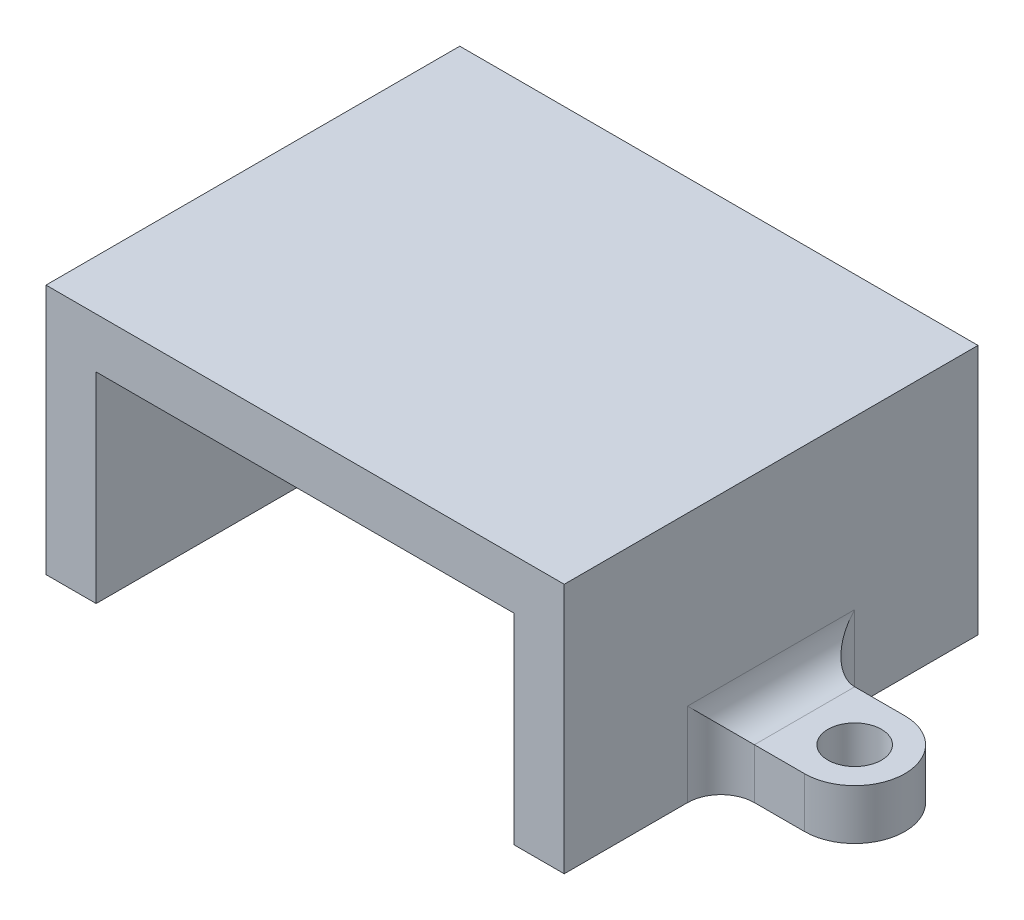
ISO-10303-21;
HEADER;
FILE_DESCRIPTION(('STEP AP214'),'2;1');
FILE_NAME('part.step','',(''),(''),'','','');
FILE_SCHEMA(('AUTOMOTIVE_DESIGN { 1 0 10303 214 1 1 1 1 }'));
ENDSEC;
DATA;
#1=APPLICATION_CONTEXT('core data for automotive mechanical design processes');
#2=APPLICATION_PROTOCOL_DEFINITION('international standard','automotive_design',2000,#1);
#3=PRODUCT_CONTEXT('',#1,'mechanical');
#4=PRODUCT('Part','Part','',(#3));
#5=PRODUCT_RELATED_PRODUCT_CATEGORY('part','',(#4));
#6=PRODUCT_DEFINITION_FORMATION('','',#4);
#7=PRODUCT_DEFINITION_CONTEXT('part definition',#1,'design');
#8=PRODUCT_DEFINITION('design','',#6,#7);
#9=PRODUCT_DEFINITION_SHAPE('','',#8);
#10=(LENGTH_UNIT() NAMED_UNIT(*) SI_UNIT(.MILLI.,.METRE.));
#11=(NAMED_UNIT(*) PLANE_ANGLE_UNIT() SI_UNIT($,.RADIAN.));
#12=(NAMED_UNIT(*) SI_UNIT($,.STERADIAN.) SOLID_ANGLE_UNIT());
#13=UNCERTAINTY_MEASURE_WITH_UNIT(LENGTH_MEASURE(1.E-05),#10,'distance_accuracy_value','');
#14=(GEOMETRIC_REPRESENTATION_CONTEXT(3) GLOBAL_UNCERTAINTY_ASSIGNED_CONTEXT((#13)) GLOBAL_UNIT_ASSIGNED_CONTEXT((#10,
#11,#12)) REPRESENTATION_CONTEXT('',''));
#15=CARTESIAN_POINT('',(0.,0.,0.));
#16=DIRECTION('',(0.,0.,1.));
#17=DIRECTION('',(1.,0.,0.));
#18=AXIS2_PLACEMENT_3D('',#15,#16,#17);
#19=CARTESIAN_POINT('',(31.,0.,24.75));
#20=DIRECTION('',(-1.,0.,0.));
#21=DIRECTION('',(0.,0.,1.));
#22=AXIS2_PLACEMENT_3D('',#19,#20,#21);
#23=PLANE('',#22);
#24=DIRECTION('',(0.,0.,-1.));
#25=VECTOR('',#24,1.);
#26=CARTESIAN_POINT('',(31.,5.,9.375));
#27=LINE('',#26,#25);
#28=CARTESIAN_POINT('',(31.,5.,17.375));
#29=VERTEX_POINT('',#28);
#30=CARTESIAN_POINT('',(31.,5.,7.375));
#31=VERTEX_POINT('',#30);
#32=EDGE_CURVE('E348',#29,#31,#27,.T.);
#33=ORIENTED_EDGE('',*,*,#32,.T.);
#34=DIRECTION('',(0.,-1.,0.));
#35=VECTOR('',#34,1.);
#36=CARTESIAN_POINT('',(31.,0.,7.375));
#37=LINE('',#36,#35);
#38=CARTESIAN_POINT('',(31.,0.,7.375));
#39=VERTEX_POINT('',#38);
#40=EDGE_CURVE('E351',#31,#39,#37,.T.);
#41=ORIENTED_EDGE('',*,*,#40,.T.);
#42=DIRECTION('',(0.,0.,-1.));
#43=VECTOR('',#42,1.);
#44=CARTESIAN_POINT('',(31.,0.,24.75));
#45=LINE('',#44,#43);
#46=CARTESIAN_POINT('',(31.,0.,0.));
#47=VERTEX_POINT('',#46);
#48=EDGE_CURVE('E320',#39,#47,#45,.T.);
#49=ORIENTED_EDGE('',*,*,#48,.T.);
#50=DIRECTION('',(0.,1.,0.));
#51=VECTOR('',#50,1.);
#52=CARTESIAN_POINT('',(31.,0.,0.));
#53=LINE('',#52,#51);
#54=CARTESIAN_POINT('',(31.,15.,0.));
#55=VERTEX_POINT('',#54);
#56=EDGE_CURVE('E308',#47,#55,#53,.T.);
#57=ORIENTED_EDGE('',*,*,#56,.T.);
#58=DIRECTION('',(0.,0.,-1.));
#59=VECTOR('',#58,1.);
#60=CARTESIAN_POINT('',(31.,15.,24.75));
#61=LINE('',#60,#59);
#62=CARTESIAN_POINT('',(31.,15.,24.75));
#63=VERTEX_POINT('',#62);
#64=EDGE_CURVE('E316',#63,#55,#61,.T.);
#65=ORIENTED_EDGE('',*,*,#64,.F.);
#66=DIRECTION('',(0.,1.,0.));
#67=VECTOR('',#66,1.);
#68=CARTESIAN_POINT('',(31.,0.,24.75));
#69=LINE('',#68,#67);
#70=CARTESIAN_POINT('',(31.,0.,24.75));
#71=VERTEX_POINT('',#70);
#72=EDGE_CURVE('E282',#71,#63,#69,.T.);
#73=ORIENTED_EDGE('',*,*,#72,.F.);
#74=CARTESIAN_POINT('',(31.,0.,17.375));
#75=VERTEX_POINT('',#74);
#76=EDGE_CURVE('E321',#71,#75,#45,.T.);
#77=ORIENTED_EDGE('',*,*,#76,.T.);
#78=DIRECTION('',(0.,-1.,0.));
#79=VECTOR('',#78,1.);
#80=CARTESIAN_POINT('',(31.,0.,17.375));
#81=LINE('',#80,#79);
#82=EDGE_CURVE('E345',#75,#29,#81,.F.);
#83=ORIENTED_EDGE('',*,*,#82,.T.);
#84=EDGE_LOOP('',(#33,#41,#49,#57,#65,#73,#77,#83));
#85=FACE_BOUND('',#84,.T.);
#86=ADVANCED_FACE('F39',(#85),#23,.F.);
#87=CARTESIAN_POINT('',(0.,15.,24.75));
#88=DIRECTION('',(1.,0.,0.));
#89=DIRECTION('',(0.,0.,-1.));
#90=AXIS2_PLACEMENT_3D('',#87,#88,#89);
#91=PLANE('',#90);
#92=DIRECTION('',(0.,0.,-1.));
#93=VECTOR('',#92,1.);
#94=CARTESIAN_POINT('',(0.,0.,24.75));
#95=LINE('',#94,#93);
#96=CARTESIAN_POINT('',(0.,0.,7.375));
#97=VERTEX_POINT('',#96);
#98=CARTESIAN_POINT('',(0.,0.,0.));
#99=VERTEX_POINT('',#98);
#100=EDGE_CURVE('E341',#97,#99,#95,.T.);
#101=ORIENTED_EDGE('',*,*,#100,.F.);
#102=DIRECTION('',(0.,-1.,0.));
#103=VECTOR('',#102,1.);
#104=CARTESIAN_POINT('',(0.,15.,7.375));
#105=LINE('',#104,#103);
#106=CARTESIAN_POINT('',(0.,5.,7.375));
#107=VERTEX_POINT('',#106);
#108=EDGE_CURVE('E373',#97,#107,#105,.F.);
#109=ORIENTED_EDGE('',*,*,#108,.T.);
#110=DIRECTION('',(0.,0.,1.));
#111=VECTOR('',#110,1.);
#112=CARTESIAN_POINT('',(0.,5.,24.75));
#113=LINE('',#112,#111);
#114=CARTESIAN_POINT('',(0.,5.,17.375));
#115=VERTEX_POINT('',#114);
#116=EDGE_CURVE('E367',#107,#115,#113,.T.);
#117=ORIENTED_EDGE('',*,*,#116,.T.);
#118=DIRECTION('',(0.,-1.,0.));
#119=VECTOR('',#118,1.);
#120=CARTESIAN_POINT('',(0.,15.,17.375));
#121=LINE('',#120,#119);
#122=CARTESIAN_POINT('',(0.,0.,17.375));
#123=VERTEX_POINT('',#122);
#124=EDGE_CURVE('E370',#115,#123,#121,.T.);
#125=ORIENTED_EDGE('',*,*,#124,.T.);
#126=CARTESIAN_POINT('',(0.,0.,24.75));
#127=VERTEX_POINT('',#126);
#128=EDGE_CURVE('E342',#127,#123,#95,.T.);
#129=ORIENTED_EDGE('',*,*,#128,.F.);
#130=DIRECTION('',(0.,-1.,0.));
#131=VECTOR('',#130,1.);
#132=CARTESIAN_POINT('',(0.,15.,24.75));
#133=LINE('',#132,#131);
#134=CARTESIAN_POINT('',(0.,15.,24.75));
#135=VERTEX_POINT('',#134);
#136=EDGE_CURVE('E262',#135,#127,#133,.T.);
#137=ORIENTED_EDGE('',*,*,#136,.F.);
#138=DIRECTION('',(0.,0.,-1.));
#139=VECTOR('',#138,1.);
#140=CARTESIAN_POINT('',(0.,15.,24.75));
#141=LINE('',#140,#139);
#142=CARTESIAN_POINT('',(0.,15.,0.));
#143=VERTEX_POINT('',#142);
#144=EDGE_CURVE('E288',#135,#143,#141,.T.);
#145=ORIENTED_EDGE('',*,*,#144,.T.);
#146=DIRECTION('',(0.,-1.,0.));
#147=VECTOR('',#146,1.);
#148=CARTESIAN_POINT('',(0.,15.,0.));
#149=LINE('',#148,#147);
#150=EDGE_CURVE('E258',#143,#99,#149,.T.);
#151=ORIENTED_EDGE('',*,*,#150,.T.);
#152=EDGE_LOOP('',(#101,#109,#117,#125,#129,#137,#145,#151));
#153=FACE_BOUND('',#152,.T.);
#154=ADVANCED_FACE('F415',(#153),#91,.F.);
#155=CARTESIAN_POINT('',(0.,0.,24.75));
#156=DIRECTION('',(0.,1.,0.));
#157=DIRECTION('',(0.,0.,1.));
#158=AXIS2_PLACEMENT_3D('',#155,#156,#157);
#159=PLANE('',#158);
#160=DIRECTION('',(1.,0.,0.));
#161=VECTOR('',#160,1.);
#162=CARTESIAN_POINT('',(0.,0.,0.));
#163=LINE('',#162,#161);
#164=CARTESIAN_POINT('',(3.,0.,0.));
#165=VERTEX_POINT('',#164);
#166=EDGE_CURVE('E292',#99,#165,#163,.T.);
#167=ORIENTED_EDGE('',*,*,#166,.T.);
#168=DIRECTION('',(0.,0.,-1.));
#169=VECTOR('',#168,1.);
#170=CARTESIAN_POINT('',(3.,0.,24.75));
#171=LINE('',#170,#169);
#172=CARTESIAN_POINT('',(3.,0.,24.75));
#173=VERTEX_POINT('',#172);
#174=EDGE_CURVE('E337',#173,#165,#171,.T.);
#175=ORIENTED_EDGE('',*,*,#174,.F.);
#176=DIRECTION('',(1.,0.,0.));
#177=VECTOR('',#176,1.);
#178=CARTESIAN_POINT('',(0.,0.,24.75));
#179=LINE('',#178,#177);
#180=EDGE_CURVE('E266',#127,#173,#179,.T.);
#181=ORIENTED_EDGE('',*,*,#180,.F.);
#182=ORIENTED_EDGE('',*,*,#128,.T.);
#183=CARTESIAN_POINT('',(-2.,0.,17.375));
#184=DIRECTION('',(0.,1.,0.));
#185=DIRECTION('',(0.,0.,1.));
#186=AXIS2_PLACEMENT_3D('',#183,#184,#185);
#187=CIRCLE('',#186,2.);
#188=CARTESIAN_POINT('',(-2.,0.,15.375));
#189=VERTEX_POINT('',#188);
#190=EDGE_CURVE('E11',#123,#189,#187,.T.);
#191=ORIENTED_EDGE('',*,*,#190,.T.);
#192=DIRECTION('',(-1.,0.,0.));
#193=VECTOR('',#192,1.);
#194=CARTESIAN_POINT('',(0.,0.,15.375));
#195=LINE('',#194,#193);
#196=CARTESIAN_POINT('',(-5.,0.,15.375));
#197=VERTEX_POINT('',#196);
#198=EDGE_CURVE('E229',#189,#197,#195,.T.);
#199=ORIENTED_EDGE('',*,*,#198,.T.);
#200=CARTESIAN_POINT('',(-5.,0.,12.375));
#201=DIRECTION('',(0.,-1.,0.));
#202=DIRECTION('',(0.,0.,1.));
#203=AXIS2_PLACEMENT_3D('',#200,#201,#202);
#204=CIRCLE('',#203,3.);
#205=CARTESIAN_POINT('',(-4.99999999999999,0.,9.375));
#206=VERTEX_POINT('',#205);
#207=EDGE_CURVE('E248',#197,#206,#204,.T.);
#208=ORIENTED_EDGE('',*,*,#207,.T.);
#209=DIRECTION('',(1.,0.,0.));
#210=VECTOR('',#209,1.);
#211=CARTESIAN_POINT('',(-4.99999999999999,0.,9.375));
#212=LINE('',#211,#210);
#213=CARTESIAN_POINT('',(-2.,0.,9.375));
#214=VERTEX_POINT('',#213);
#215=EDGE_CURVE('E237',#206,#214,#212,.T.);
#216=ORIENTED_EDGE('',*,*,#215,.T.);
#217=CARTESIAN_POINT('',(-2.,0.,7.375));
#218=DIRECTION('',(0.,1.,0.));
#219=DIRECTION('',(0.,0.,1.));
#220=AXIS2_PLACEMENT_3D('',#217,#218,#219);
#221=CIRCLE('',#220,2.);
#222=EDGE_CURVE('E49',#214,#97,#221,.T.);
#223=ORIENTED_EDGE('',*,*,#222,.T.);
#224=ORIENTED_EDGE('',*,*,#100,.T.);
#225=EDGE_LOOP('',(#167,#175,#181,#182,#191,#199,#208,#216,#223,#224));
#226=FACE_BOUND('',#225,.T.);
#227=CARTESIAN_POINT('',(-5.,0.,12.375));
#228=DIRECTION('',(0.,-1.,0.));
#229=DIRECTION('',(0.,0.,1.));
#230=AXIS2_PLACEMENT_3D('',#227,#228,#229);
#231=CIRCLE('',#230,1.6);
#232=CARTESIAN_POINT('',(-5.,0.,13.975));
#233=VERTEX_POINT('',#232);
#234=EDGE_CURVE('E223',#233,#233,#231,.T.);
#235=ORIENTED_EDGE('',*,*,#234,.F.);
#236=EDGE_LOOP('',(#235));
#237=FACE_BOUND('',#236,.T.);
#238=ADVANCED_FACE('F417',(#226,#237),#159,.F.);
#239=CARTESIAN_POINT('',(3.,0.,24.75));
#240=DIRECTION('',(-1.,0.,0.));
#241=DIRECTION('',(0.,-1.,0.));
#242=AXIS2_PLACEMENT_3D('',#239,#240,#241);
#243=PLANE('',#242);
#244=DIRECTION('',(0.,1.,0.));
#245=VECTOR('',#244,1.);
#246=CARTESIAN_POINT('',(3.,0.,0.));
#247=LINE('',#246,#245);
#248=CARTESIAN_POINT('',(3.,12.,0.));
#249=VERTEX_POINT('',#248);
#250=EDGE_CURVE('E295',#165,#249,#247,.T.);
#251=ORIENTED_EDGE('',*,*,#250,.T.);
#252=DIRECTION('',(0.,0.,-1.));
#253=VECTOR('',#252,1.);
#254=CARTESIAN_POINT('',(3.,12.,24.75));
#255=LINE('',#254,#253);
#256=CARTESIAN_POINT('',(3.,12.,24.75));
#257=VERTEX_POINT('',#256);
#258=EDGE_CURVE('E333',#257,#249,#255,.T.);
#259=ORIENTED_EDGE('',*,*,#258,.F.);
#260=DIRECTION('',(0.,1.,0.));
#261=VECTOR('',#260,1.);
#262=CARTESIAN_POINT('',(3.,0.,24.75));
#263=LINE('',#262,#261);
#264=EDGE_CURVE('E270',#173,#257,#263,.T.);
#265=ORIENTED_EDGE('',*,*,#264,.F.);
#266=ORIENTED_EDGE('',*,*,#174,.T.);
#267=EDGE_LOOP('',(#251,#259,#265,#266));
#268=FACE_BOUND('',#267,.T.);
#269=ADVANCED_FACE('F435',(#268),#243,.F.);
#270=CARTESIAN_POINT('',(3.,12.,24.75));
#271=DIRECTION('',(0.,1.,0.));
#272=DIRECTION('',(0.,0.,1.));
#273=AXIS2_PLACEMENT_3D('',#270,#271,#272);
#274=PLANE('',#273);
#275=DIRECTION('',(1.,0.,0.));
#276=VECTOR('',#275,1.);
#277=CARTESIAN_POINT('',(3.,12.,0.));
#278=LINE('',#277,#276);
#279=CARTESIAN_POINT('',(28.,12.,0.));
#280=VERTEX_POINT('',#279);
#281=EDGE_CURVE('E298',#249,#280,#278,.T.);
#282=ORIENTED_EDGE('',*,*,#281,.T.);
#283=DIRECTION('',(0.,0.,-1.));
#284=VECTOR('',#283,1.);
#285=CARTESIAN_POINT('',(28.,12.,24.75));
#286=LINE('',#285,#284);
#287=CARTESIAN_POINT('',(28.,12.,24.75));
#288=VERTEX_POINT('',#287);
#289=EDGE_CURVE('E329',#288,#280,#286,.T.);
#290=ORIENTED_EDGE('',*,*,#289,.F.);
#291=DIRECTION('',(1.,0.,0.));
#292=VECTOR('',#291,1.);
#293=CARTESIAN_POINT('',(3.,12.,24.75));
#294=LINE('',#293,#292);
#295=EDGE_CURVE('E273',#257,#288,#294,.T.);
#296=ORIENTED_EDGE('',*,*,#295,.F.);
#297=ORIENTED_EDGE('',*,*,#258,.T.);
#298=EDGE_LOOP('',(#282,#290,#296,#297));
#299=FACE_BOUND('',#298,.T.);
#300=ADVANCED_FACE('F442',(#299),#274,.F.);
#301=CARTESIAN_POINT('',(28.,12.,24.75));
#302=DIRECTION('',(1.,0.,0.));
#303=DIRECTION('',(0.,0.,-1.));
#304=AXIS2_PLACEMENT_3D('',#301,#302,#303);
#305=PLANE('',#304);
#306=DIRECTION('',(0.,-1.,0.));
#307=VECTOR('',#306,1.);
#308=CARTESIAN_POINT('',(28.,12.,0.));
#309=LINE('',#308,#307);
#310=CARTESIAN_POINT('',(28.,0.,0.));
#311=VERTEX_POINT('',#310);
#312=EDGE_CURVE('E301',#280,#311,#309,.T.);
#313=ORIENTED_EDGE('',*,*,#312,.T.);
#314=DIRECTION('',(0.,0.,-1.));
#315=VECTOR('',#314,1.);
#316=CARTESIAN_POINT('',(28.,0.,24.75));
#317=LINE('',#316,#315);
#318=CARTESIAN_POINT('',(28.,0.,24.75));
#319=VERTEX_POINT('',#318);
#320=EDGE_CURVE('E325',#319,#311,#317,.T.);
#321=ORIENTED_EDGE('',*,*,#320,.F.);
#322=DIRECTION('',(0.,-1.,0.));
#323=VECTOR('',#322,1.);
#324=CARTESIAN_POINT('',(28.,12.,24.75));
#325=LINE('',#324,#323);
#326=EDGE_CURVE('E276',#288,#319,#325,.T.);
#327=ORIENTED_EDGE('',*,*,#326,.F.);
#328=ORIENTED_EDGE('',*,*,#289,.T.);
#329=EDGE_LOOP('',(#313,#321,#327,#328));
#330=FACE_BOUND('',#329,.T.);
#331=ADVANCED_FACE('F445',(#330),#305,.F.);
#332=CARTESIAN_POINT('',(28.,0.,24.75));
#333=DIRECTION('',(0.,1.,0.));
#334=DIRECTION('',(0.,0.,1.));
#335=AXIS2_PLACEMENT_3D('',#332,#333,#334);
#336=PLANE('',#335);
#337=DIRECTION('',(1.,0.,0.));
#338=VECTOR('',#337,1.);
#339=CARTESIAN_POINT('',(28.,0.,0.));
#340=LINE('',#339,#338);
#341=EDGE_CURVE('E304',#311,#47,#340,.T.);
#342=ORIENTED_EDGE('',*,*,#341,.T.);
#343=ORIENTED_EDGE('',*,*,#48,.F.);
#344=CARTESIAN_POINT('',(33.,0.,7.375));
#345=DIRECTION('',(0.,1.,0.));
#346=DIRECTION('',(0.,0.,1.));
#347=AXIS2_PLACEMENT_3D('',#344,#345,#346);
#348=CIRCLE('',#347,2.);
#349=CARTESIAN_POINT('',(33.,0.,9.375));
#350=VERTEX_POINT('',#349);
#351=EDGE_CURVE('E381',#39,#350,#348,.T.);
#352=ORIENTED_EDGE('',*,*,#351,.T.);
#353=DIRECTION('',(1.,0.,0.));
#354=VECTOR('',#353,1.);
#355=CARTESIAN_POINT('',(36.,0.,9.375));
#356=LINE('',#355,#354);
#357=CARTESIAN_POINT('',(36.,0.,9.375));
#358=VERTEX_POINT('',#357);
#359=EDGE_CURVE('E206',#350,#358,#356,.T.);
#360=ORIENTED_EDGE('',*,*,#359,.T.);
#361=CARTESIAN_POINT('',(36.,0.,12.375));
#362=DIRECTION('',(0.,-1.,0.));
#363=DIRECTION('',(0.,0.,-1.));
#364=AXIS2_PLACEMENT_3D('',#361,#362,#363);
#365=CIRCLE('',#364,3.);
#366=CARTESIAN_POINT('',(36.,0.,15.375));
#367=VERTEX_POINT('',#366);
#368=EDGE_CURVE('E216',#358,#367,#365,.T.);
#369=ORIENTED_EDGE('',*,*,#368,.T.);
#370=DIRECTION('',(-1.,0.,0.));
#371=VECTOR('',#370,1.);
#372=CARTESIAN_POINT('',(31.,0.,15.375));
#373=LINE('',#372,#371);
#374=CARTESIAN_POINT('',(33.,0.,15.375));
#375=VERTEX_POINT('',#374);
#376=EDGE_CURVE('E184',#367,#375,#373,.T.);
#377=ORIENTED_EDGE('',*,*,#376,.T.);
#378=CARTESIAN_POINT('',(33.,0.,17.375));
#379=DIRECTION('',(0.,1.,0.));
#380=DIRECTION('',(0.,0.,1.));
#381=AXIS2_PLACEMENT_3D('',#378,#379,#380);
#382=CIRCLE('',#381,2.);
#383=EDGE_CURVE('E384',#375,#75,#382,.T.);
#384=ORIENTED_EDGE('',*,*,#383,.T.);
#385=ORIENTED_EDGE('',*,*,#76,.F.);
#386=DIRECTION('',(1.,0.,0.));
#387=VECTOR('',#386,1.);
#388=CARTESIAN_POINT('',(28.,0.,24.75));
#389=LINE('',#388,#387);
#390=EDGE_CURVE('E279',#319,#71,#389,.T.);
#391=ORIENTED_EDGE('',*,*,#390,.F.);
#392=ORIENTED_EDGE('',*,*,#320,.T.);
#393=EDGE_LOOP('',(#342,#343,#352,#360,#369,#377,#384,#385,#391,#392));
#394=FACE_BOUND('',#393,.T.);
#395=CARTESIAN_POINT('',(36.,0.,12.375));
#396=DIRECTION('',(0.,-1.,0.));
#397=DIRECTION('',(0.,0.,-1.));
#398=AXIS2_PLACEMENT_3D('',#395,#396,#397);
#399=CIRCLE('',#398,1.6);
#400=CARTESIAN_POINT('',(36.,0.,10.775));
#401=VERTEX_POINT('',#400);
#402=EDGE_CURVE('E211',#401,#401,#399,.T.);
#403=ORIENTED_EDGE('',*,*,#402,.F.);
#404=EDGE_LOOP('',(#403));
#405=FACE_BOUND('',#404,.T.);
#406=ADVANCED_FACE('F450',(#394,#405),#336,.F.);
#407=CARTESIAN_POINT('',(31.,15.,24.75));
#408=DIRECTION('',(0.,-1.,0.));
#409=DIRECTION('',(1.,0.,0.));
#410=AXIS2_PLACEMENT_3D('',#407,#408,#409);
#411=PLANE('',#410);
#412=DIRECTION('',(-1.,0.,0.));
#413=VECTOR('',#412,1.);
#414=CARTESIAN_POINT('',(31.,15.,0.));
#415=LINE('',#414,#413);
#416=EDGE_CURVE('E267',#55,#143,#415,.T.);
#417=ORIENTED_EDGE('',*,*,#416,.T.);
#418=ORIENTED_EDGE('',*,*,#144,.F.);
#419=DIRECTION('',(-1.,0.,0.));
#420=VECTOR('',#419,1.);
#421=CARTESIAN_POINT('',(31.,15.,24.75));
#422=LINE('',#421,#420);
#423=EDGE_CURVE('E285',#63,#135,#422,.T.);
#424=ORIENTED_EDGE('',*,*,#423,.F.);
#425=ORIENTED_EDGE('',*,*,#64,.T.);
#426=EDGE_LOOP('',(#417,#418,#424,#425));
#427=FACE_BOUND('',#426,.T.);
#428=ADVANCED_FACE('F455',(#427),#411,.F.);
#429=CARTESIAN_POINT('',(0.,0.,24.75));
#430=DIRECTION('',(0.,0.,1.));
#431=DIRECTION('',(1.,0.,0.));
#432=AXIS2_PLACEMENT_3D('',#429,#430,#431);
#433=PLANE('',#432);
#434=ORIENTED_EDGE('',*,*,#136,.T.);
#435=ORIENTED_EDGE('',*,*,#180,.T.);
#436=ORIENTED_EDGE('',*,*,#264,.T.);
#437=ORIENTED_EDGE('',*,*,#295,.T.);
#438=ORIENTED_EDGE('',*,*,#326,.T.);
#439=ORIENTED_EDGE('',*,*,#390,.T.);
#440=ORIENTED_EDGE('',*,*,#72,.T.);
#441=ORIENTED_EDGE('',*,*,#423,.T.);
#442=EDGE_LOOP('',(#434,#435,#436,#437,#438,#439,#440,#441));
#443=FACE_BOUND('',#442,.T.);
#444=ADVANCED_FACE('F422',(#443),#433,.T.);
#445=CARTESIAN_POINT('',(0.,0.,0.));
#446=DIRECTION('',(0.,0.,1.));
#447=DIRECTION('',(1.,0.,0.));
#448=AXIS2_PLACEMENT_3D('',#445,#446,#447);
#449=PLANE('',#448);
#450=ORIENTED_EDGE('',*,*,#150,.F.);
#451=ORIENTED_EDGE('',*,*,#416,.F.);
#452=ORIENTED_EDGE('',*,*,#56,.F.);
#453=ORIENTED_EDGE('',*,*,#341,.F.);
#454=ORIENTED_EDGE('',*,*,#312,.F.);
#455=ORIENTED_EDGE('',*,*,#281,.F.);
#456=ORIENTED_EDGE('',*,*,#250,.F.);
#457=ORIENTED_EDGE('',*,*,#166,.F.);
#458=EDGE_LOOP('',(#450,#451,#452,#453,#454,#455,#456,#457));
#459=FACE_BOUND('',#458,.T.);
#460=ADVANCED_FACE('F430',(#459),#449,.F.);
#461=CARTESIAN_POINT('',(0.,3.,15.375));
#462=DIRECTION('',(0.,0.,1.));
#463=DIRECTION('',(1.,0.,0.));
#464=AXIS2_PLACEMENT_3D('',#461,#462,#463);
#465=PLANE('',#464);
#466=ORIENTED_EDGE('',*,*,#198,.F.);
#467=DIRECTION('',(0.,-1.,0.));
#468=VECTOR('',#467,1.);
#469=CARTESIAN_POINT('',(-2.,3.,15.375));
#470=LINE('',#469,#468);
#471=CARTESIAN_POINT('',(-2.,3.,15.375));
#472=VERTEX_POINT('',#471);
#473=EDGE_CURVE('E57',#189,#472,#470,.F.);
#474=ORIENTED_EDGE('',*,*,#473,.T.);
#475=DIRECTION('',(-1.,0.,0.));
#476=VECTOR('',#475,1.);
#477=CARTESIAN_POINT('',(0.,3.,15.375));
#478=LINE('',#477,#476);
#479=CARTESIAN_POINT('',(-5.,3.,15.375));
#480=VERTEX_POINT('',#479);
#481=EDGE_CURVE('E233',#472,#480,#478,.T.);
#482=ORIENTED_EDGE('',*,*,#481,.T.);
#483=DIRECTION('',(0.,-1.,0.));
#484=VECTOR('',#483,1.);
#485=CARTESIAN_POINT('',(-5.,3.,15.375));
#486=LINE('',#485,#484);
#487=EDGE_CURVE('E245',#480,#197,#486,.T.);
#488=ORIENTED_EDGE('',*,*,#487,.T.);
#489=EDGE_LOOP('',(#466,#474,#482,#488));
#490=FACE_BOUND('',#489,.T.);
#491=ADVANCED_FACE('F579',(#490),#465,.T.);
#492=CARTESIAN_POINT('',(-4.99999999999999,3.,9.375));
#493=DIRECTION('',(0.,0.,-1.));
#494=DIRECTION('',(-1.,0.,0.));
#495=AXIS2_PLACEMENT_3D('',#492,#493,#494);
#496=PLANE('',#495);
#497=DIRECTION('',(1.,0.,0.));
#498=VECTOR('',#497,1.);
#499=CARTESIAN_POINT('',(-4.99999999999999,3.,9.375));
#500=LINE('',#499,#498);
#501=CARTESIAN_POINT('',(-4.99999999999999,3.,9.375));
#502=VERTEX_POINT('',#501);
#503=CARTESIAN_POINT('',(-2.,3.,9.375));
#504=VERTEX_POINT('',#503);
#505=EDGE_CURVE('E241',#502,#504,#500,.T.);
#506=ORIENTED_EDGE('',*,*,#505,.T.);
#507=DIRECTION('',(0.,-1.,0.));
#508=VECTOR('',#507,1.);
#509=CARTESIAN_POINT('',(-2.,3.,9.375));
#510=LINE('',#509,#508);
#511=EDGE_CURVE('E363',#504,#214,#510,.T.);
#512=ORIENTED_EDGE('',*,*,#511,.T.);
#513=ORIENTED_EDGE('',*,*,#215,.F.);
#514=DIRECTION('',(0.,-1.,0.));
#515=VECTOR('',#514,1.);
#516=CARTESIAN_POINT('',(-4.99999999999999,3.,9.375));
#517=LINE('',#516,#515);
#518=EDGE_CURVE('E255',#502,#206,#517,.T.);
#519=ORIENTED_EDGE('',*,*,#518,.F.);
#520=EDGE_LOOP('',(#506,#512,#513,#519));
#521=FACE_BOUND('',#520,.T.);
#522=ADVANCED_FACE('F571',(#521),#496,.T.);
#523=CARTESIAN_POINT('',(-5.,3.,12.375));
#524=DIRECTION('',(0.,-1.,0.));
#525=DIRECTION('',(0.,0.,-1.));
#526=AXIS2_PLACEMENT_3D('',#523,#524,#525);
#527=CYLINDRICAL_SURFACE('',#526,3.);
#528=ORIENTED_EDGE('',*,*,#207,.F.);
#529=ORIENTED_EDGE('',*,*,#487,.F.);
#530=CARTESIAN_POINT('',(-5.,3.,12.375));
#531=DIRECTION('',(0.,-1.,0.));
#532=DIRECTION('',(0.,0.,1.));
#533=AXIS2_PLACEMENT_3D('',#530,#531,#532);
#534=CIRCLE('',#533,3.);
#535=EDGE_CURVE('E236',#480,#502,#534,.T.);
#536=ORIENTED_EDGE('',*,*,#535,.T.);
#537=ORIENTED_EDGE('',*,*,#518,.T.);
#538=EDGE_LOOP('',(#528,#529,#536,#537));
#539=FACE_BOUND('',#538,.T.);
#540=ADVANCED_FACE('F563',(#539),#527,.T.);
#541=CARTESIAN_POINT('',(-5.,3.,12.375));
#542=DIRECTION('',(0.,1.,0.));
#543=DIRECTION('',(0.,0.,1.));
#544=AXIS2_PLACEMENT_3D('',#541,#542,#543);
#545=PLANE('',#544);
#546=CARTESIAN_POINT('',(-5.,3.,12.375));
#547=DIRECTION('',(0.,-1.,0.));
#548=DIRECTION('',(0.,0.,1.));
#549=AXIS2_PLACEMENT_3D('',#546,#547,#548);
#550=CIRCLE('',#549,1.6);
#551=CARTESIAN_POINT('',(-5.,3.,13.975));
#552=VERTEX_POINT('',#551);
#553=EDGE_CURVE('E225',#552,#552,#550,.T.);
#554=ORIENTED_EDGE('',*,*,#553,.T.);
#555=EDGE_LOOP('',(#554));
#556=FACE_BOUND('',#555,.T.);
#557=ORIENTED_EDGE('',*,*,#481,.F.);
#558=DIRECTION('',(0.,0.,1.));
#559=VECTOR('',#558,1.);
#560=CARTESIAN_POINT('',(-2.,3.,12.375));
#561=LINE('',#560,#559);
#562=EDGE_CURVE('E378',#472,#504,#561,.F.);
#563=ORIENTED_EDGE('',*,*,#562,.T.);
#564=ORIENTED_EDGE('',*,*,#505,.F.);
#565=ORIENTED_EDGE('',*,*,#535,.F.);
#566=EDGE_LOOP('',(#557,#563,#564,#565));
#567=FACE_BOUND('',#566,.T.);
#568=ADVANCED_FACE('F555',(#556,#567),#545,.T.);
#569=CARTESIAN_POINT('',(-5.,3.,12.375));
#570=DIRECTION('',(0.,-1.,0.));
#571=DIRECTION('',(0.,0.,-1.));
#572=AXIS2_PLACEMENT_3D('',#569,#570,#571);
#573=CYLINDRICAL_SURFACE('',#572,1.6);
#574=ORIENTED_EDGE('',*,*,#553,.F.);
#575=EDGE_LOOP('',(#574));
#576=FACE_BOUND('',#575,.T.);
#577=ORIENTED_EDGE('',*,*,#234,.T.);
#578=EDGE_LOOP('',(#577));
#579=FACE_BOUND('',#578,.T.);
#580=ADVANCED_FACE('F548',(#576,#579),#573,.F.);
#581=CARTESIAN_POINT('',(36.,3.,12.375));
#582=DIRECTION('',(0.,-1.,0.));
#583=DIRECTION('',(0.,0.,-1.));
#584=AXIS2_PLACEMENT_3D('',#581,#582,#583);
#585=CYLINDRICAL_SURFACE('',#584,3.);
#586=ORIENTED_EDGE('',*,*,#368,.F.);
#587=DIRECTION('',(0.,-1.,0.));
#588=VECTOR('',#587,1.);
#589=CARTESIAN_POINT('',(36.,3.,9.375));
#590=LINE('',#589,#588);
#591=CARTESIAN_POINT('',(36.,3.,9.375));
#592=VERTEX_POINT('',#591);
#593=EDGE_CURVE('E190',#592,#358,#590,.T.);
#594=ORIENTED_EDGE('',*,*,#593,.F.);
#595=CARTESIAN_POINT('',(36.,3.,12.375));
#596=DIRECTION('',(0.,-1.,0.));
#597=DIRECTION('',(0.,0.,-1.));
#598=AXIS2_PLACEMENT_3D('',#595,#596,#597);
#599=CIRCLE('',#598,3.);
#600=CARTESIAN_POINT('',(36.,3.,15.375));
#601=VERTEX_POINT('',#600);
#602=EDGE_CURVE('E197',#592,#601,#599,.T.);
#603=ORIENTED_EDGE('',*,*,#602,.T.);
#604=DIRECTION('',(0.,-1.,0.));
#605=VECTOR('',#604,1.);
#606=CARTESIAN_POINT('',(36.,3.,15.375));
#607=LINE('',#606,#605);
#608=EDGE_CURVE('E178',#601,#367,#607,.T.);
#609=ORIENTED_EDGE('',*,*,#608,.T.);
#610=EDGE_LOOP('',(#586,#594,#603,#609));
#611=FACE_BOUND('',#610,.T.);
#612=ADVANCED_FACE('F203',(#611),#585,.T.);
#613=CARTESIAN_POINT('',(36.,3.,9.375));
#614=DIRECTION('',(0.,0.,-1.));
#615=DIRECTION('',(-1.,0.,0.));
#616=AXIS2_PLACEMENT_3D('',#613,#614,#615);
#617=PLANE('',#616);
#618=ORIENTED_EDGE('',*,*,#359,.F.);
#619=DIRECTION('',(0.,-1.,0.));
#620=VECTOR('',#619,1.);
#621=CARTESIAN_POINT('',(33.,3.,9.375));
#622=LINE('',#621,#620);
#623=CARTESIAN_POINT('',(33.,3.,9.375));
#624=VERTEX_POINT('',#623);
#625=EDGE_CURVE('E355',#350,#624,#622,.F.);
#626=ORIENTED_EDGE('',*,*,#625,.T.);
#627=DIRECTION('',(1.,0.,0.));
#628=VECTOR('',#627,1.);
#629=CARTESIAN_POINT('',(36.,3.,9.375));
#630=LINE('',#629,#628);
#631=EDGE_CURVE('E191',#624,#592,#630,.T.);
#632=ORIENTED_EDGE('',*,*,#631,.T.);
#633=ORIENTED_EDGE('',*,*,#593,.T.);
#634=EDGE_LOOP('',(#618,#626,#632,#633));
#635=FACE_BOUND('',#634,.T.);
#636=ADVANCED_FACE('F534',(#635),#617,.T.);
#637=CARTESIAN_POINT('',(31.,3.,15.375));
#638=DIRECTION('',(0.,0.,1.));
#639=DIRECTION('',(1.,0.,0.));
#640=AXIS2_PLACEMENT_3D('',#637,#638,#639);
#641=PLANE('',#640);
#642=DIRECTION('',(-1.,0.,0.));
#643=VECTOR('',#642,1.);
#644=CARTESIAN_POINT('',(31.,3.,15.375));
#645=LINE('',#644,#643);
#646=CARTESIAN_POINT('',(33.,3.,15.375));
#647=VERTEX_POINT('',#646);
#648=EDGE_CURVE('E181',#601,#647,#645,.T.);
#649=ORIENTED_EDGE('',*,*,#648,.T.);
#650=DIRECTION('',(0.,-1.,0.));
#651=VECTOR('',#650,1.);
#652=CARTESIAN_POINT('',(33.,3.,15.375));
#653=LINE('',#652,#651);
#654=EDGE_CURVE('E360',#647,#375,#653,.T.);
#655=ORIENTED_EDGE('',*,*,#654,.T.);
#656=ORIENTED_EDGE('',*,*,#376,.F.);
#657=ORIENTED_EDGE('',*,*,#608,.F.);
#658=EDGE_LOOP('',(#649,#655,#656,#657));
#659=FACE_BOUND('',#658,.T.);
#660=ADVANCED_FACE('F180',(#659),#641,.T.);
#661=CARTESIAN_POINT('',(36.,3.,12.375));
#662=DIRECTION('',(0.,-1.,0.));
#663=DIRECTION('',(0.,0.,-1.));
#664=AXIS2_PLACEMENT_3D('',#661,#662,#663);
#665=PLANE('',#664);
#666=CARTESIAN_POINT('',(36.,3.,12.375));
#667=DIRECTION('',(0.,-1.,0.));
#668=DIRECTION('',(0.,0.,-1.));
#669=AXIS2_PLACEMENT_3D('',#666,#667,#668);
#670=CIRCLE('',#669,1.6);
#671=CARTESIAN_POINT('',(36.,3.,10.775));
#672=VERTEX_POINT('',#671);
#673=EDGE_CURVE('E219',#672,#672,#670,.T.);
#674=ORIENTED_EDGE('',*,*,#673,.T.);
#675=EDGE_LOOP('',(#674));
#676=FACE_BOUND('',#675,.T.);
#677=ORIENTED_EDGE('',*,*,#631,.F.);
#678=DIRECTION('',(0.,0.,-1.));
#679=VECTOR('',#678,1.);
#680=CARTESIAN_POINT('',(33.,3.,15.375));
#681=LINE('',#680,#679);
#682=EDGE_CURVE('E199',#624,#647,#681,.F.);
#683=ORIENTED_EDGE('',*,*,#682,.T.);
#684=ORIENTED_EDGE('',*,*,#648,.F.);
#685=ORIENTED_EDGE('',*,*,#602,.F.);
#686=EDGE_LOOP('',(#677,#683,#684,#685));
#687=FACE_BOUND('',#686,.T.);
#688=ADVANCED_FACE('F196',(#676,#687),#665,.F.);
#689=CARTESIAN_POINT('',(36.,3.,12.375));
#690=DIRECTION('',(0.,-1.,0.));
#691=DIRECTION('',(0.,0.,-1.));
#692=AXIS2_PLACEMENT_3D('',#689,#690,#691);
#693=CYLINDRICAL_SURFACE('',#692,1.6);
#694=ORIENTED_EDGE('',*,*,#673,.F.);
#695=EDGE_LOOP('',(#694));
#696=FACE_BOUND('',#695,.T.);
#697=ORIENTED_EDGE('',*,*,#402,.T.);
#698=EDGE_LOOP('',(#697));
#699=FACE_BOUND('',#698,.T.);
#700=ADVANCED_FACE('F491',(#696,#699),#693,.F.);
#701=CARTESIAN_POINT('',(33.,3.,17.375));
#702=DIRECTION('',(0.,-1.,0.));
#703=DIRECTION('',(0.,0.,-1.));
#704=AXIS2_PLACEMENT_3D('',#701,#702,#703);
#705=CYLINDRICAL_SURFACE('',#704,2.);
#706=ORIENTED_EDGE('',*,*,#383,.F.);
#707=ORIENTED_EDGE('',*,*,#654,.F.);
#708=CARTESIAN_POINT('',(33.,5.,17.375));
#709=DIRECTION('',(0.,-0.707106781186547,0.707106781186547));
#710=DIRECTION('',(0.,-0.707106781186547,-0.707106781186547));
#711=AXIS2_PLACEMENT_3D('',#708,#709,#710);
#712=ELLIPSE('',#711,2.82842712474619,2.);
#713=EDGE_CURVE('E393',#29,#647,#712,.T.);
#714=ORIENTED_EDGE('',*,*,#713,.F.);
#715=ORIENTED_EDGE('',*,*,#82,.F.);
#716=EDGE_LOOP('',(#706,#707,#714,#715));
#717=FACE_BOUND('',#716,.T.);
#718=ADVANCED_FACE('F487',(#717),#705,.F.);
#719=CARTESIAN_POINT('',(33.,5.,24.75));
#720=DIRECTION('',(0.,0.,1.));
#721=DIRECTION('',(1.,0.,0.));
#722=AXIS2_PLACEMENT_3D('',#719,#720,#721);
#723=CYLINDRICAL_SURFACE('',#722,2.);
#724=ORIENTED_EDGE('',*,*,#713,.T.);
#725=ORIENTED_EDGE('',*,*,#682,.F.);
#726=CARTESIAN_POINT('',(33.,5.,7.375));
#727=DIRECTION('',(0.,0.707106781186547,0.707106781186547));
#728=DIRECTION('',(0.,-0.707106781186547,0.707106781186547));
#729=AXIS2_PLACEMENT_3D('',#726,#727,#728);
#730=ELLIPSE('',#729,2.82842712474619,2.);
#731=EDGE_CURVE('E389',#31,#624,#730,.T.);
#732=ORIENTED_EDGE('',*,*,#731,.F.);
#733=ORIENTED_EDGE('',*,*,#32,.F.);
#734=EDGE_LOOP('',(#724,#725,#732,#733));
#735=FACE_BOUND('',#734,.T.);
#736=ADVANCED_FACE('F483',(#735),#723,.F.);
#737=CARTESIAN_POINT('',(33.,0.,7.375));
#738=DIRECTION('',(0.,-1.,0.));
#739=DIRECTION('',(0.,0.,-1.));
#740=AXIS2_PLACEMENT_3D('',#737,#738,#739);
#741=CYLINDRICAL_SURFACE('',#740,2.);
#742=ORIENTED_EDGE('',*,*,#731,.T.);
#743=ORIENTED_EDGE('',*,*,#625,.F.);
#744=ORIENTED_EDGE('',*,*,#351,.F.);
#745=ORIENTED_EDGE('',*,*,#40,.F.);
#746=EDGE_LOOP('',(#742,#743,#744,#745));
#747=FACE_BOUND('',#746,.T.);
#748=ADVANCED_FACE('F480',(#747),#741,.F.);
#749=CARTESIAN_POINT('',(-2.,15.,17.375));
#750=DIRECTION('',(0.,-1.,0.));
#751=DIRECTION('',(0.,0.,-1.));
#752=AXIS2_PLACEMENT_3D('',#749,#750,#751);
#753=CYLINDRICAL_SURFACE('',#752,2.);
#754=ORIENTED_EDGE('',*,*,#190,.F.);
#755=ORIENTED_EDGE('',*,*,#124,.F.);
#756=CARTESIAN_POINT('',(-2.,5.,17.375));
#757=DIRECTION('',(0.,-0.707106781186547,0.707106781186547));
#758=DIRECTION('',(0.,0.707106781186547,0.707106781186547));
#759=AXIS2_PLACEMENT_3D('',#756,#757,#758);
#760=ELLIPSE('',#759,2.82842712474619,2.);
#761=EDGE_CURVE('E43',#472,#115,#760,.T.);
#762=ORIENTED_EDGE('',*,*,#761,.F.);
#763=ORIENTED_EDGE('',*,*,#473,.F.);
#764=EDGE_LOOP('',(#754,#755,#762,#763));
#765=FACE_BOUND('',#764,.T.);
#766=ADVANCED_FACE('F41',(#765),#753,.F.);
#767=CARTESIAN_POINT('',(-2.,5.,24.75));
#768=DIRECTION('',(0.,0.,1.));
#769=DIRECTION('',(1.,0.,0.));
#770=AXIS2_PLACEMENT_3D('',#767,#768,#769);
#771=CYLINDRICAL_SURFACE('',#770,2.);
#772=ORIENTED_EDGE('',*,*,#761,.T.);
#773=ORIENTED_EDGE('',*,*,#116,.F.);
#774=CARTESIAN_POINT('',(-2.,5.,7.375));
#775=DIRECTION('',(0.,0.707106781186547,0.707106781186547));
#776=DIRECTION('',(0.,-0.707106781186547,0.707106781186547));
#777=AXIS2_PLACEMENT_3D('',#774,#775,#776);
#778=ELLIPSE('',#777,2.82842712474619,2.);
#779=EDGE_CURVE('E396',#504,#107,#778,.T.);
#780=ORIENTED_EDGE('',*,*,#779,.F.);
#781=ORIENTED_EDGE('',*,*,#562,.F.);
#782=EDGE_LOOP('',(#772,#773,#780,#781));
#783=FACE_BOUND('',#782,.T.);
#784=ADVANCED_FACE('F409',(#783),#771,.F.);
#785=CARTESIAN_POINT('',(-2.,3.,7.375));
#786=DIRECTION('',(0.,-1.,0.));
#787=DIRECTION('',(0.,0.,-1.));
#788=AXIS2_PLACEMENT_3D('',#785,#786,#787);
#789=CYLINDRICAL_SURFACE('',#788,2.);
#790=ORIENTED_EDGE('',*,*,#779,.T.);
#791=ORIENTED_EDGE('',*,*,#108,.F.);
#792=ORIENTED_EDGE('',*,*,#222,.F.);
#793=ORIENTED_EDGE('',*,*,#511,.F.);
#794=EDGE_LOOP('',(#790,#791,#792,#793));
#795=FACE_BOUND('',#794,.T.);
#796=ADVANCED_FACE('F493',(#795),#789,.F.);
#797=CLOSED_SHELL('',(#86,#154,#238,#269,#300,#331,#406,#428,#444,#460,#491,#522,#540,#568,#580,
#612,#636,#660,#688,#700,#718,#736,#748,#766,#784,#796));
#798=MANIFOLD_SOLID_BREP('B2',#797);
#799=ADVANCED_BREP_SHAPE_REPRESENTATION('',(#18,#798),#14);
#800=SHAPE_DEFINITION_REPRESENTATION(#9,#799);
ENDSEC;
END-ISO-10303-21;
